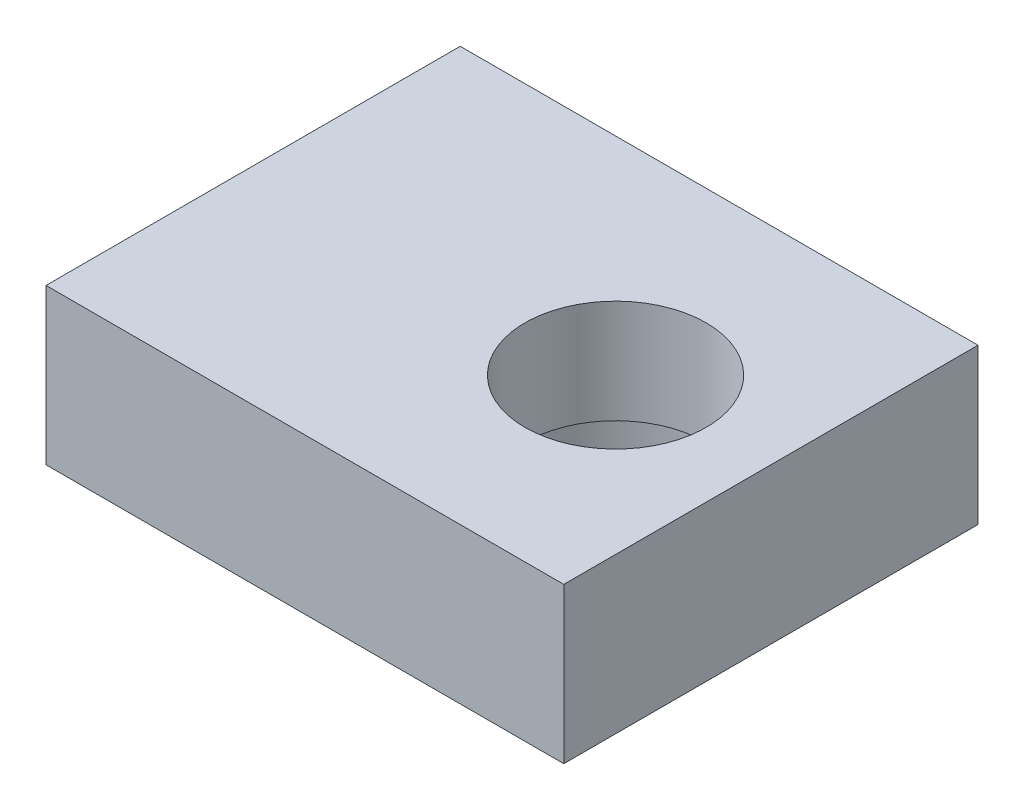
ISO-10303-21;
HEADER;
FILE_DESCRIPTION(('STEP AP214'),'2;1');
FILE_NAME('part.step','',(''),(''),'','','');
FILE_SCHEMA(('AUTOMOTIVE_DESIGN { 1 0 10303 214 1 1 1 1 }'));
ENDSEC;
DATA;
#1=APPLICATION_CONTEXT('core data for automotive mechanical design processes');
#2=APPLICATION_PROTOCOL_DEFINITION('international standard','automotive_design',2000,#1);
#3=PRODUCT_CONTEXT('',#1,'mechanical');
#4=PRODUCT('Part','Part','',(#3));
#5=PRODUCT_RELATED_PRODUCT_CATEGORY('part','',(#4));
#6=PRODUCT_DEFINITION_FORMATION('','',#4);
#7=PRODUCT_DEFINITION_CONTEXT('part definition',#1,'design');
#8=PRODUCT_DEFINITION('design','',#6,#7);
#9=PRODUCT_DEFINITION_SHAPE('','',#8);
#10=(LENGTH_UNIT() NAMED_UNIT(*) SI_UNIT(.MILLI.,.METRE.));
#11=(NAMED_UNIT(*) PLANE_ANGLE_UNIT() SI_UNIT($,.RADIAN.));
#12=(NAMED_UNIT(*) SI_UNIT($,.STERADIAN.) SOLID_ANGLE_UNIT());
#13=UNCERTAINTY_MEASURE_WITH_UNIT(LENGTH_MEASURE(1.E-05),#10,'distance_accuracy_value','');
#14=(GEOMETRIC_REPRESENTATION_CONTEXT(3) GLOBAL_UNCERTAINTY_ASSIGNED_CONTEXT((#13)) GLOBAL_UNIT_ASSIGNED_CONTEXT((#10,
#11,#12)) REPRESENTATION_CONTEXT('',''));
#15=CARTESIAN_POINT('',(0.,0.,0.));
#16=DIRECTION('',(0.,0.,1.));
#17=DIRECTION('',(1.,0.,0.));
#18=AXIS2_PLACEMENT_3D('',#15,#16,#17);
#19=CARTESIAN_POINT('',(25.4,0.,0.));
#20=DIRECTION('',(-1.,0.,0.));
#21=DIRECTION('',(0.,0.,1.));
#22=AXIS2_PLACEMENT_3D('',#19,#20,#21);
#23=PLANE('',#22);
#24=CARTESIAN_POINT('',(25.4,6.35,38.1));
#25=DIRECTION('',(-1.,0.,0.));
#26=DIRECTION('',(0.,0.,1.));
#27=AXIS2_PLACEMENT_3D('',#24,#25,#26);
#28=CIRCLE('',#27,2.0193);
#29=CARTESIAN_POINT('',(25.4,6.35,40.1193));
#30=VERTEX_POINT('',#29);
#31=EDGE_CURVE('E20',#30,#30,#28,.T.);
#32=ORIENTED_EDGE('',*,*,#31,.T.);
#33=EDGE_LOOP('',(#32));
#34=FACE_BOUND('',#33,.T.);
#35=ADVANCED_FACE('F17',(#34),#23,.T.);
#36=CARTESIAN_POINT('',(25.4,0.,0.));
#37=DIRECTION('',(-1.,0.,0.));
#38=DIRECTION('',(0.,0.,1.));
#39=AXIS2_PLACEMENT_3D('',#36,#37,#38);
#40=PLANE('',#39);
#41=CARTESIAN_POINT('',(25.4,6.35,12.7));
#42=DIRECTION('',(-1.,0.,0.));
#43=DIRECTION('',(0.,0.,1.));
#44=AXIS2_PLACEMENT_3D('',#41,#42,#43);
#45=CIRCLE('',#44,2.0193);
#46=CARTESIAN_POINT('',(25.4,6.35,14.7193));
#47=VERTEX_POINT('',#46);
#48=EDGE_CURVE('E98',#47,#47,#45,.T.);
#49=ORIENTED_EDGE('',*,*,#48,.T.);
#50=EDGE_LOOP('',(#49));
#51=FACE_BOUND('',#50,.T.);
#52=ADVANCED_FACE('F119',(#51),#40,.T.);
#53=CARTESIAN_POINT('',(44.45,0.,25.4));
#54=DIRECTION('',(0.,1.,0.));
#55=DIRECTION('',(0.,0.,1.));
#56=AXIS2_PLACEMENT_3D('',#53,#54,#55);
#57=CYLINDRICAL_SURFACE('',#56,14.2875);
#58=CARTESIAN_POINT('',(44.45,6.35,25.4));
#59=DIRECTION('',(0.,1.,0.));
#60=DIRECTION('',(0.,0.,1.));
#61=AXIS2_PLACEMENT_3D('',#58,#59,#60);
#62=CIRCLE('',#61,14.2875);
#63=CARTESIAN_POINT('',(44.45,6.35,39.6875));
#64=VERTEX_POINT('',#63);
#65=EDGE_CURVE('E69',#64,#64,#62,.T.);
#66=ORIENTED_EDGE('',*,*,#65,.T.);
#67=EDGE_LOOP('',(#66));
#68=FACE_BOUND('',#67,.T.);
#69=CARTESIAN_POINT('',(44.45,0.,25.4));
#70=DIRECTION('',(0.,1.,0.));
#71=DIRECTION('',(0.,0.,1.));
#72=AXIS2_PLACEMENT_3D('',#69,#70,#71);
#73=CIRCLE('',#72,14.2875);
#74=CARTESIAN_POINT('',(44.45,0.,39.6875));
#75=VERTEX_POINT('',#74);
#76=EDGE_CURVE('E96',#75,#75,#73,.T.);
#77=ORIENTED_EDGE('',*,*,#76,.F.);
#78=EDGE_LOOP('',(#77));
#79=FACE_BOUND('',#78,.T.);
#80=ADVANCED_FACE('F109',(#68,#79),#57,.F.);
#81=CARTESIAN_POINT('',(12.7,6.35,38.1));
#82=DIRECTION('',(-1.,0.,0.));
#83=DIRECTION('',(0.,0.,1.));
#84=AXIS2_PLACEMENT_3D('',#81,#82,#83);
#85=CYLINDRICAL_SURFACE('',#84,2.0193);
#86=CARTESIAN_POINT('',(0.,6.35,38.1));
#87=DIRECTION('',(-1.,0.,0.));
#88=DIRECTION('',(0.,0.,1.));
#89=AXIS2_PLACEMENT_3D('',#86,#87,#88);
#90=CIRCLE('',#89,2.0193);
#91=CARTESIAN_POINT('',(0.,6.35,40.1193));
#92=VERTEX_POINT('',#91);
#93=EDGE_CURVE('E74',#92,#92,#90,.T.);
#94=ORIENTED_EDGE('',*,*,#93,.T.);
#95=EDGE_LOOP('',(#94));
#96=FACE_BOUND('',#95,.T.);
#97=ORIENTED_EDGE('',*,*,#31,.F.);
#98=EDGE_LOOP('',(#97));
#99=FACE_BOUND('',#98,.T.);
#100=ADVANCED_FACE('F106',(#96,#99),#85,.F.);
#101=CARTESIAN_POINT('',(12.7,6.35,12.7));
#102=DIRECTION('',(-1.,0.,0.));
#103=DIRECTION('',(0.,0.,1.));
#104=AXIS2_PLACEMENT_3D('',#101,#102,#103);
#105=CYLINDRICAL_SURFACE('',#104,2.0193);
#106=CARTESIAN_POINT('',(0.,6.35,12.7));
#107=DIRECTION('',(-1.,0.,0.));
#108=DIRECTION('',(0.,0.,1.));
#109=AXIS2_PLACEMENT_3D('',#106,#107,#108);
#110=CIRCLE('',#109,2.0193);
#111=CARTESIAN_POINT('',(0.,6.35,14.7193));
#112=VERTEX_POINT('',#111);
#113=EDGE_CURVE('E88',#112,#112,#110,.T.);
#114=ORIENTED_EDGE('',*,*,#113,.T.);
#115=EDGE_LOOP('',(#114));
#116=FACE_BOUND('',#115,.T.);
#117=ORIENTED_EDGE('',*,*,#48,.F.);
#118=EDGE_LOOP('',(#117));
#119=FACE_BOUND('',#118,.T.);
#120=ADVANCED_FACE('F108',(#116,#119),#105,.F.);
#121=CARTESIAN_POINT('',(0.,0.,50.8));
#122=DIRECTION('',(0.,-1.,0.));
#123=DIRECTION('',(0.,0.,-1.));
#124=AXIS2_PLACEMENT_3D('',#121,#122,#123);
#125=PLANE('',#124);
#126=ORIENTED_EDGE('',*,*,#76,.T.);
#127=EDGE_LOOP('',(#126));
#128=FACE_BOUND('',#127,.T.);
#129=DIRECTION('',(-1.,0.,0.));
#130=VECTOR('',#129,1.);
#131=CARTESIAN_POINT('',(0.,0.,0.));
#132=LINE('',#131,#130);
#133=CARTESIAN_POINT('',(63.5,0.,0.));
#134=VERTEX_POINT('',#133);
#135=CARTESIAN_POINT('',(0.,0.,0.));
#136=VERTEX_POINT('',#135);
#137=EDGE_CURVE('E60',#134,#136,#132,.T.);
#138=ORIENTED_EDGE('',*,*,#137,.F.);
#139=DIRECTION('',(0.,0.,-1.));
#140=VECTOR('',#139,1.);
#141=CARTESIAN_POINT('',(63.5,0.,0.));
#142=LINE('',#141,#140);
#143=CARTESIAN_POINT('',(63.5,0.,50.8));
#144=VERTEX_POINT('',#143);
#145=EDGE_CURVE('E87',#144,#134,#142,.T.);
#146=ORIENTED_EDGE('',*,*,#145,.F.);
#147=DIRECTION('',(1.,0.,0.));
#148=VECTOR('',#147,1.);
#149=CARTESIAN_POINT('',(0.,0.,50.8));
#150=LINE('',#149,#148);
#151=CARTESIAN_POINT('',(0.,0.,50.8));
#152=VERTEX_POINT('',#151);
#153=EDGE_CURVE('E72',#152,#144,#150,.T.);
#154=ORIENTED_EDGE('',*,*,#153,.F.);
#155=DIRECTION('',(0.,0.,-1.));
#156=VECTOR('',#155,1.);
#157=CARTESIAN_POINT('',(0.,0.,0.));
#158=LINE('',#157,#156);
#159=EDGE_CURVE('E55',#152,#136,#158,.T.);
#160=ORIENTED_EDGE('',*,*,#159,.T.);
#161=EDGE_LOOP('',(#138,#146,#154,#160));
#162=FACE_BOUND('',#161,.T.);
#163=ADVANCED_FACE('F71',(#128,#162),#125,.T.);
#164=CARTESIAN_POINT('',(55.5625,6.35,25.4));
#165=DIRECTION('',(0.,1.,0.));
#166=DIRECTION('',(0.,0.,1.));
#167=AXIS2_PLACEMENT_3D('',#164,#165,#166);
#168=PLANE('',#167);
#169=CARTESIAN_POINT('',(44.45,6.35,25.4));
#170=DIRECTION('',(0.,1.,0.));
#171=DIRECTION('',(0.,0.,1.));
#172=AXIS2_PLACEMENT_3D('',#169,#170,#171);
#173=CIRCLE('',#172,11.1125);
#174=CARTESIAN_POINT('',(44.45,6.35,36.5125));
#175=VERTEX_POINT('',#174);
#176=EDGE_CURVE('E83',#175,#175,#173,.T.);
#177=ORIENTED_EDGE('',*,*,#176,.T.);
#178=EDGE_LOOP('',(#177));
#179=FACE_BOUND('',#178,.T.);
#180=ORIENTED_EDGE('',*,*,#65,.F.);
#181=EDGE_LOOP('',(#180));
#182=FACE_BOUND('',#181,.T.);
#183=ADVANCED_FACE('F146',(#179,#182),#168,.F.);
#184=CARTESIAN_POINT('',(0.,0.,0.));
#185=DIRECTION('',(0.,0.,-1.));
#186=DIRECTION('',(-1.,0.,0.));
#187=AXIS2_PLACEMENT_3D('',#184,#185,#186);
#188=PLANE('',#187);
#189=DIRECTION('',(1.,0.,0.));
#190=VECTOR('',#189,1.);
#191=CARTESIAN_POINT('',(0.,19.05,0.));
#192=LINE('',#191,#190);
#193=CARTESIAN_POINT('',(63.5,19.05,0.));
#194=VERTEX_POINT('',#193);
#195=CARTESIAN_POINT('',(0.,19.05,0.));
#196=VERTEX_POINT('',#195);
#197=EDGE_CURVE('E86',#194,#196,#192,.F.);
#198=ORIENTED_EDGE('',*,*,#197,.F.);
#199=DIRECTION('',(0.,1.,0.));
#200=VECTOR('',#199,1.);
#201=CARTESIAN_POINT('',(63.5,0.,0.));
#202=LINE('',#201,#200);
#203=EDGE_CURVE('E65',#134,#194,#202,.T.);
#204=ORIENTED_EDGE('',*,*,#203,.F.);
#205=ORIENTED_EDGE('',*,*,#137,.T.);
#206=DIRECTION('',(0.,1.,0.));
#207=VECTOR('',#206,1.);
#208=CARTESIAN_POINT('',(0.,0.,0.));
#209=LINE('',#208,#207);
#210=EDGE_CURVE('E62',#136,#196,#209,.T.);
#211=ORIENTED_EDGE('',*,*,#210,.T.);
#212=EDGE_LOOP('',(#198,#204,#205,#211));
#213=FACE_BOUND('',#212,.T.);
#214=ADVANCED_FACE('F61',(#213),#188,.T.);
#215=CARTESIAN_POINT('',(0.,0.,0.));
#216=DIRECTION('',(1.,0.,0.));
#217=DIRECTION('',(0.,0.,-1.));
#218=AXIS2_PLACEMENT_3D('',#215,#216,#217);
#219=PLANE('',#218);
#220=ORIENTED_EDGE('',*,*,#113,.F.);
#221=EDGE_LOOP('',(#220));
#222=FACE_BOUND('',#221,.T.);
#223=ORIENTED_EDGE('',*,*,#93,.F.);
#224=EDGE_LOOP('',(#223));
#225=FACE_BOUND('',#224,.T.);
#226=DIRECTION('',(0.,1.,0.));
#227=VECTOR('',#226,1.);
#228=CARTESIAN_POINT('',(0.,19.05,50.8));
#229=LINE('',#228,#227);
#230=CARTESIAN_POINT('',(0.,19.05,50.8));
#231=VERTEX_POINT('',#230);
#232=EDGE_CURVE('E91',#231,#152,#229,.F.);
#233=ORIENTED_EDGE('',*,*,#232,.F.);
#234=DIRECTION('',(0.,0.,1.));
#235=VECTOR('',#234,1.);
#236=CARTESIAN_POINT('',(0.,19.05,0.));
#237=LINE('',#236,#235);
#238=EDGE_CURVE('E78',#196,#231,#237,.T.);
#239=ORIENTED_EDGE('',*,*,#238,.F.);
#240=ORIENTED_EDGE('',*,*,#210,.F.);
#241=ORIENTED_EDGE('',*,*,#159,.F.);
#242=EDGE_LOOP('',(#233,#239,#240,#241));
#243=FACE_BOUND('',#242,.T.);
#244=ADVANCED_FACE('F76',(#222,#225,#243),#219,.F.);
#245=CARTESIAN_POINT('',(0.,19.05,50.8));
#246=DIRECTION('',(0.,0.,1.));
#247=DIRECTION('',(1.,0.,0.));
#248=AXIS2_PLACEMENT_3D('',#245,#246,#247);
#249=PLANE('',#248);
#250=ORIENTED_EDGE('',*,*,#153,.T.);
#251=DIRECTION('',(0.,1.,0.));
#252=VECTOR('',#251,1.);
#253=CARTESIAN_POINT('',(63.5,0.,50.8));
#254=LINE('',#253,#252);
#255=CARTESIAN_POINT('',(63.5,19.05,50.8));
#256=VERTEX_POINT('',#255);
#257=EDGE_CURVE('E35',#256,#144,#254,.F.);
#258=ORIENTED_EDGE('',*,*,#257,.F.);
#259=DIRECTION('',(1.,0.,0.));
#260=VECTOR('',#259,1.);
#261=CARTESIAN_POINT('',(0.,19.05,50.8));
#262=LINE('',#261,#260);
#263=EDGE_CURVE('E260',#231,#256,#262,.T.);
#264=ORIENTED_EDGE('',*,*,#263,.F.);
#265=ORIENTED_EDGE('',*,*,#232,.T.);
#266=EDGE_LOOP('',(#250,#258,#264,#265));
#267=FACE_BOUND('',#266,.T.);
#268=ADVANCED_FACE('F137',(#267),#249,.T.);
#269=CARTESIAN_POINT('',(63.5,0.,0.));
#270=DIRECTION('',(1.,0.,0.));
#271=DIRECTION('',(0.,0.,-1.));
#272=AXIS2_PLACEMENT_3D('',#269,#270,#271);
#273=PLANE('',#272);
#274=ORIENTED_EDGE('',*,*,#257,.T.);
#275=ORIENTED_EDGE('',*,*,#145,.T.);
#276=ORIENTED_EDGE('',*,*,#203,.T.);
#277=DIRECTION('',(0.,0.,1.));
#278=VECTOR('',#277,1.);
#279=CARTESIAN_POINT('',(63.5,19.05,0.));
#280=LINE('',#279,#278);
#281=EDGE_CURVE('E26',#256,#194,#280,.F.);
#282=ORIENTED_EDGE('',*,*,#281,.F.);
#283=EDGE_LOOP('',(#274,#275,#276,#282));
#284=FACE_BOUND('',#283,.T.);
#285=ADVANCED_FACE('F130',(#284),#273,.T.);
#286=CARTESIAN_POINT('',(44.45,0.,25.4));
#287=DIRECTION('',(0.,1.,0.));
#288=DIRECTION('',(0.,0.,1.));
#289=AXIS2_PLACEMENT_3D('',#286,#287,#288);
#290=CYLINDRICAL_SURFACE('',#289,11.1125);
#291=ORIENTED_EDGE('',*,*,#176,.F.);
#292=EDGE_LOOP('',(#291));
#293=FACE_BOUND('',#292,.T.);
#294=CARTESIAN_POINT('',(44.45,19.05,25.4));
#295=DIRECTION('',(0.,1.,0.));
#296=DIRECTION('',(0.,0.,1.));
#297=AXIS2_PLACEMENT_3D('',#294,#295,#296);
#298=CIRCLE('',#297,11.1125);
#299=CARTESIAN_POINT('',(44.45,19.05,36.5125));
#300=VERTEX_POINT('',#299);
#301=EDGE_CURVE('E11',#300,#300,#298,.F.);
#302=ORIENTED_EDGE('',*,*,#301,.F.);
#303=EDGE_LOOP('',(#302));
#304=FACE_BOUND('',#303,.T.);
#305=ADVANCED_FACE('F124',(#293,#304),#290,.F.);
#306=CARTESIAN_POINT('',(0.,19.05,0.));
#307=DIRECTION('',(0.,1.,0.));
#308=DIRECTION('',(0.,0.,1.));
#309=AXIS2_PLACEMENT_3D('',#306,#307,#308);
#310=PLANE('',#309);
#311=ORIENTED_EDGE('',*,*,#301,.T.);
#312=EDGE_LOOP('',(#311));
#313=FACE_BOUND('',#312,.T.);
#314=ORIENTED_EDGE('',*,*,#263,.T.);
#315=ORIENTED_EDGE('',*,*,#281,.T.);
#316=ORIENTED_EDGE('',*,*,#197,.T.);
#317=ORIENTED_EDGE('',*,*,#238,.T.);
#318=EDGE_LOOP('',(#314,#315,#316,#317));
#319=FACE_BOUND('',#318,.T.);
#320=ADVANCED_FACE('F122',(#313,#319),#310,.T.);
#321=CLOSED_SHELL('',(#35,#52,#80,#100,#120,#163,#183,#214,#244,#268,#285,#305,#320));
#322=MANIFOLD_SOLID_BREP('B1',#321);
#323=ADVANCED_BREP_SHAPE_REPRESENTATION('',(#18,#322),#14);
#324=SHAPE_DEFINITION_REPRESENTATION(#9,#323);
ENDSEC;
END-ISO-10303-21;
